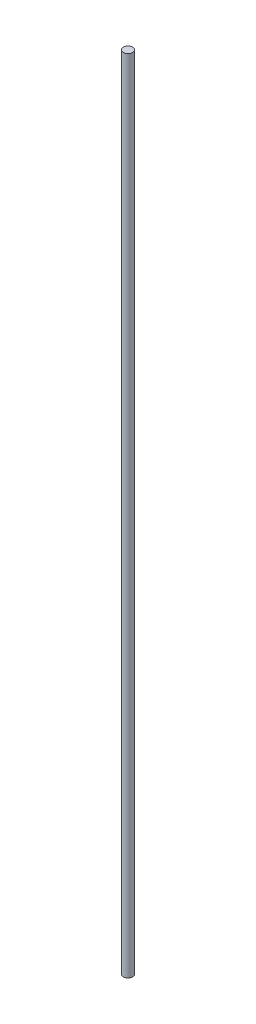
ISO-10303-21;
HEADER;
FILE_DESCRIPTION(('STEP AP214'),'2;1');
FILE_NAME('part.step','',(''),(''),'','','');
FILE_SCHEMA(('AUTOMOTIVE_DESIGN { 1 0 10303 214 1 1 1 1 }'));
ENDSEC;
DATA;
#1=APPLICATION_CONTEXT('core data for automotive mechanical design processes');
#2=APPLICATION_PROTOCOL_DEFINITION('international standard','automotive_design',2000,#1);
#3=PRODUCT_CONTEXT('',#1,'mechanical');
#4=PRODUCT('Part','Part','',(#3));
#5=PRODUCT_RELATED_PRODUCT_CATEGORY('part','',(#4));
#6=PRODUCT_DEFINITION_FORMATION('','',#4);
#7=PRODUCT_DEFINITION_CONTEXT('part definition',#1,'design');
#8=PRODUCT_DEFINITION('design','',#6,#7);
#9=PRODUCT_DEFINITION_SHAPE('','',#8);
#10=(LENGTH_UNIT() NAMED_UNIT(*) SI_UNIT(.MILLI.,.METRE.));
#11=(NAMED_UNIT(*) PLANE_ANGLE_UNIT() SI_UNIT($,.RADIAN.));
#12=(NAMED_UNIT(*) SI_UNIT($,.STERADIAN.) SOLID_ANGLE_UNIT());
#13=UNCERTAINTY_MEASURE_WITH_UNIT(LENGTH_MEASURE(1.E-05),#10,'distance_accuracy_value','');
#14=(GEOMETRIC_REPRESENTATION_CONTEXT(3) GLOBAL_UNCERTAINTY_ASSIGNED_CONTEXT((#13)) GLOBAL_UNIT_ASSIGNED_CONTEXT((#10,
#11,#12)) REPRESENTATION_CONTEXT('',''));
#15=CARTESIAN_POINT('',(0.,0.,0.));
#16=DIRECTION('',(0.,0.,1.));
#17=DIRECTION('',(1.,0.,0.));
#18=AXIS2_PLACEMENT_3D('',#15,#16,#17);
#19=CARTESIAN_POINT('',(0.,150.,0.));
#20=DIRECTION('',(0.,-1.,0.));
#21=DIRECTION('',(0.,0.,-1.));
#22=AXIS2_PLACEMENT_3D('',#19,#20,#21);
#23=CYLINDRICAL_SURFACE('',#22,0.875);
#24=CARTESIAN_POINT('',(0.,150.,0.));
#25=DIRECTION('',(0.,1.,0.));
#26=DIRECTION('',(0.,0.,1.));
#27=AXIS2_PLACEMENT_3D('',#24,#25,#26);
#28=CIRCLE('',#27,0.875);
#29=CARTESIAN_POINT('',(0.,150.,0.875));
#30=VERTEX_POINT('',#29);
#31=EDGE_CURVE('E10',#30,#30,#28,.T.);
#32=ORIENTED_EDGE('',*,*,#31,.F.);
#33=EDGE_LOOP('',(#32));
#34=FACE_BOUND('',#33,.T.);
#35=CARTESIAN_POINT('',(0.,0.,0.));
#36=DIRECTION('',(0.,1.,0.));
#37=DIRECTION('',(0.,0.,1.));
#38=AXIS2_PLACEMENT_3D('',#35,#36,#37);
#39=CIRCLE('',#38,0.875);
#40=CARTESIAN_POINT('',(0.,0.,0.875));
#41=VERTEX_POINT('',#40);
#42=EDGE_CURVE('E34',#41,#41,#39,.T.);
#43=ORIENTED_EDGE('',*,*,#42,.T.);
#44=EDGE_LOOP('',(#43));
#45=FACE_BOUND('',#44,.T.);
#46=ADVANCED_FACE('F31',(#34,#45),#23,.T.);
#47=CARTESIAN_POINT('',(0.,150.,0.));
#48=DIRECTION('',(0.,1.,0.));
#49=DIRECTION('',(0.,0.,1.));
#50=AXIS2_PLACEMENT_3D('',#47,#48,#49);
#51=PLANE('',#50);
#52=ORIENTED_EDGE('',*,*,#31,.T.);
#53=EDGE_LOOP('',(#52));
#54=FACE_BOUND('',#53,.T.);
#55=ADVANCED_FACE('F46',(#54),#51,.T.);
#56=CARTESIAN_POINT('',(0.,0.,0.));
#57=DIRECTION('',(0.,1.,0.));
#58=DIRECTION('',(0.,0.,1.));
#59=AXIS2_PLACEMENT_3D('',#56,#57,#58);
#60=PLANE('',#59);
#61=ORIENTED_EDGE('',*,*,#42,.F.);
#62=EDGE_LOOP('',(#61));
#63=FACE_BOUND('',#62,.T.);
#64=ADVANCED_FACE('F44',(#63),#60,.F.);
#65=CLOSED_SHELL('',(#46,#55,#64));
#66=MANIFOLD_SOLID_BREP('B2',#65);
#67=ADVANCED_BREP_SHAPE_REPRESENTATION('',(#18,#66),#14);
#68=SHAPE_DEFINITION_REPRESENTATION(#9,#67);
ENDSEC;
END-ISO-10303-21;
